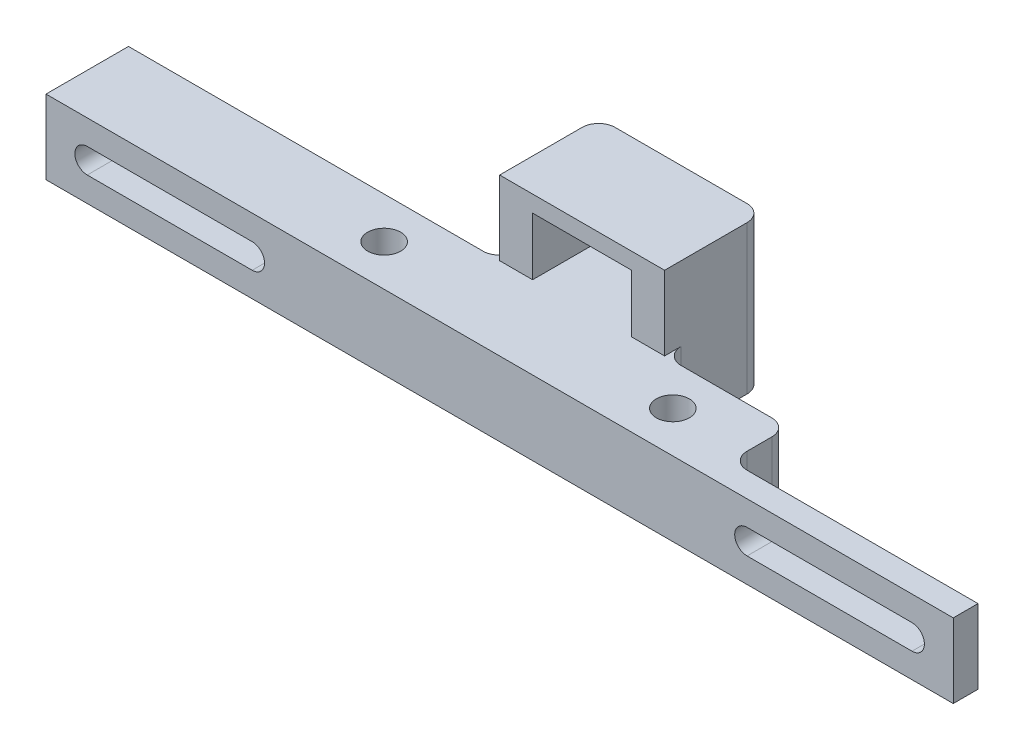
ISO-10303-21;
HEADER;
FILE_DESCRIPTION(('STEP AP214'),'2;1');
FILE_NAME('part.step','',(''),(''),'','','');
FILE_SCHEMA(('AUTOMOTIVE_DESIGN { 1 0 10303 214 1 1 1 1 }'));
ENDSEC;
DATA;
#1=APPLICATION_CONTEXT('core data for automotive mechanical design processes');
#2=APPLICATION_PROTOCOL_DEFINITION('international standard','automotive_design',2000,#1);
#3=PRODUCT_CONTEXT('',#1,'mechanical');
#4=PRODUCT('Part','Part','',(#3));
#5=PRODUCT_RELATED_PRODUCT_CATEGORY('part','',(#4));
#6=PRODUCT_DEFINITION_FORMATION('','',#4);
#7=PRODUCT_DEFINITION_CONTEXT('part definition',#1,'design');
#8=PRODUCT_DEFINITION('design','',#6,#7);
#9=PRODUCT_DEFINITION_SHAPE('','',#8);
#10=(LENGTH_UNIT() NAMED_UNIT(*) SI_UNIT(.MILLI.,.METRE.));
#11=(NAMED_UNIT(*) PLANE_ANGLE_UNIT() SI_UNIT($,.RADIAN.));
#12=(NAMED_UNIT(*) SI_UNIT($,.STERADIAN.) SOLID_ANGLE_UNIT());
#13=UNCERTAINTY_MEASURE_WITH_UNIT(LENGTH_MEASURE(1.E-05),#10,'distance_accuracy_value','');
#14=(GEOMETRIC_REPRESENTATION_CONTEXT(3) GLOBAL_UNCERTAINTY_ASSIGNED_CONTEXT((#13)) GLOBAL_UNIT_ASSIGNED_CONTEXT((#10,
#11,#12)) REPRESENTATION_CONTEXT('',''));
#15=CARTESIAN_POINT('',(0.,0.,0.));
#16=DIRECTION('',(0.,0.,1.));
#17=DIRECTION('',(1.,0.,0.));
#18=AXIS2_PLACEMENT_3D('',#15,#16,#17);
#19=CARTESIAN_POINT('',(0.,0.,0.));
#20=DIRECTION('',(0.,0.,1.));
#21=DIRECTION('',(1.,0.,0.));
#22=AXIS2_PLACEMENT_3D('',#19,#20,#21);
#23=PLANE('',#22);
#24=DIRECTION('',(-1.,0.,0.));
#25=VECTOR('',#24,1.);
#26=CARTESIAN_POINT('',(0.,4.5,0.));
#27=LINE('',#26,#25);
#28=CARTESIAN_POINT('',(23.,4.5,0.));
#29=VERTEX_POINT('',#28);
#30=CARTESIAN_POINT('',(12.,4.5,0.));
#31=VERTEX_POINT('',#30);
#32=EDGE_CURVE('E285',#29,#31,#27,.T.);
#33=ORIENTED_EDGE('',*,*,#32,.F.);
#34=DIRECTION('',(0.,1.,0.));
#35=VECTOR('',#34,1.);
#36=CARTESIAN_POINT('',(23.,0.,0.));
#37=LINE('',#36,#35);
#38=CARTESIAN_POINT('',(23.,-4.5,0.));
#39=VERTEX_POINT('',#38);
#40=EDGE_CURVE('E319',#29,#39,#37,.F.);
#41=ORIENTED_EDGE('',*,*,#40,.T.);
#42=DIRECTION('',(-1.,0.,0.));
#43=VECTOR('',#42,1.);
#44=CARTESIAN_POINT('',(0.,-4.5,0.));
#45=LINE('',#44,#43);
#46=CARTESIAN_POINT('',(12.,-4.5,0.));
#47=VERTEX_POINT('',#46);
#48=EDGE_CURVE('E307',#39,#47,#45,.T.);
#49=ORIENTED_EDGE('',*,*,#48,.T.);
#50=DIRECTION('',(0.,-1.,0.));
#51=VECTOR('',#50,1.);
#52=CARTESIAN_POINT('',(12.,4.5,0.));
#53=LINE('',#52,#51);
#54=EDGE_CURVE('E306',#47,#31,#53,.F.);
#55=ORIENTED_EDGE('',*,*,#54,.T.);
#56=EDGE_LOOP('',(#33,#41,#49,#55));
#57=FACE_BOUND('',#56,.T.);
#58=ADVANCED_FACE('F33',(#57),#23,.F.);
#59=CARTESIAN_POINT('',(-30.,0.,10.));
#60=DIRECTION('',(0.,0.,-1.));
#61=DIRECTION('',(-1.,0.,0.));
#62=AXIS2_PLACEMENT_3D('',#59,#60,#61);
#63=CYLINDRICAL_SURFACE('',#62,1.5);
#64=CARTESIAN_POINT('',(-30.,0.,0.));
#65=DIRECTION('',(0.,0.,1.));
#66=DIRECTION('',(1.,0.,0.));
#67=AXIS2_PLACEMENT_3D('',#64,#65,#66);
#68=CIRCLE('',#67,1.5);
#69=CARTESIAN_POINT('',(-30.,-1.5,0.));
#70=VERTEX_POINT('',#69);
#71=CARTESIAN_POINT('',(-30.,1.5,0.));
#72=VERTEX_POINT('',#71);
#73=EDGE_CURVE('E310',#70,#72,#68,.T.);
#74=ORIENTED_EDGE('',*,*,#73,.F.);
#75=DIRECTION('',(0.,0.,-1.));
#76=VECTOR('',#75,1.);
#77=CARTESIAN_POINT('',(-30.,-1.5,10.));
#78=LINE('',#77,#76);
#79=CARTESIAN_POINT('',(-30.,-1.5,10.));
#80=VERTEX_POINT('',#79);
#81=EDGE_CURVE('E356',#80,#70,#78,.T.);
#82=ORIENTED_EDGE('',*,*,#81,.F.);
#83=CARTESIAN_POINT('',(-30.,0.,10.));
#84=DIRECTION('',(0.,0.,1.));
#85=DIRECTION('',(1.,0.,0.));
#86=AXIS2_PLACEMENT_3D('',#83,#84,#85);
#87=CIRCLE('',#86,1.5);
#88=CARTESIAN_POINT('',(-30.,1.5,10.));
#89=VERTEX_POINT('',#88);
#90=EDGE_CURVE('E424',#80,#89,#87,.T.);
#91=ORIENTED_EDGE('',*,*,#90,.T.);
#92=DIRECTION('',(0.,0.,-1.));
#93=VECTOR('',#92,1.);
#94=CARTESIAN_POINT('',(-30.,1.5,10.));
#95=LINE('',#94,#93);
#96=EDGE_CURVE('E269',#89,#72,#95,.T.);
#97=ORIENTED_EDGE('',*,*,#96,.T.);
#98=EDGE_LOOP('',(#74,#82,#91,#97));
#99=FACE_BOUND('',#98,.T.);
#100=ADVANCED_FACE('F449',(#99),#63,.F.);
#101=CARTESIAN_POINT('',(0.,-1.5,10.));
#102=DIRECTION('',(0.,1.,0.));
#103=DIRECTION('',(-1.,0.,0.));
#104=AXIS2_PLACEMENT_3D('',#101,#102,#103);
#105=PLANE('',#104);
#106=DIRECTION('',(1.,0.,0.));
#107=VECTOR('',#106,1.);
#108=CARTESIAN_POINT('',(0.,-1.5,0.));
#109=LINE('',#108,#107);
#110=CARTESIAN_POINT('',(-50.,-1.5,0.));
#111=VERTEX_POINT('',#110);
#112=EDGE_CURVE('E461',#111,#70,#109,.T.);
#113=ORIENTED_EDGE('',*,*,#112,.F.);
#114=DIRECTION('',(0.,0.,-1.));
#115=VECTOR('',#114,1.);
#116=CARTESIAN_POINT('',(-50.,-1.5,10.));
#117=LINE('',#116,#115);
#118=CARTESIAN_POINT('',(-50.,-1.5,10.));
#119=VERTEX_POINT('',#118);
#120=EDGE_CURVE('E453',#119,#111,#117,.T.);
#121=ORIENTED_EDGE('',*,*,#120,.F.);
#122=DIRECTION('',(1.,0.,0.));
#123=VECTOR('',#122,1.);
#124=CARTESIAN_POINT('',(0.,-1.5,10.));
#125=LINE('',#124,#123);
#126=EDGE_CURVE('E427',#119,#80,#125,.T.);
#127=ORIENTED_EDGE('',*,*,#126,.T.);
#128=ORIENTED_EDGE('',*,*,#81,.T.);
#129=EDGE_LOOP('',(#113,#121,#127,#128));
#130=FACE_BOUND('',#129,.T.);
#131=ADVANCED_FACE('F464',(#130),#105,.T.);
#132=CARTESIAN_POINT('',(-50.,0.,10.));
#133=DIRECTION('',(0.,0.,-1.));
#134=DIRECTION('',(-1.,0.,0.));
#135=AXIS2_PLACEMENT_3D('',#132,#133,#134);
#136=CYLINDRICAL_SURFACE('',#135,1.5);
#137=CARTESIAN_POINT('',(-50.,0.,0.));
#138=DIRECTION('',(0.,0.,1.));
#139=DIRECTION('',(1.,0.,0.));
#140=AXIS2_PLACEMENT_3D('',#137,#138,#139);
#141=CIRCLE('',#140,1.5);
#142=CARTESIAN_POINT('',(-50.,1.5,0.));
#143=VERTEX_POINT('',#142);
#144=EDGE_CURVE('E459',#143,#111,#141,.T.);
#145=ORIENTED_EDGE('',*,*,#144,.F.);
#146=DIRECTION('',(0.,0.,-1.));
#147=VECTOR('',#146,1.);
#148=CARTESIAN_POINT('',(-50.,1.5,10.));
#149=LINE('',#148,#147);
#150=CARTESIAN_POINT('',(-50.,1.5,10.));
#151=VERTEX_POINT('',#150);
#152=EDGE_CURVE('E447',#151,#143,#149,.T.);
#153=ORIENTED_EDGE('',*,*,#152,.F.);
#154=CARTESIAN_POINT('',(-50.,0.,10.));
#155=DIRECTION('',(0.,0.,1.));
#156=DIRECTION('',(1.,0.,0.));
#157=AXIS2_PLACEMENT_3D('',#154,#155,#156);
#158=CIRCLE('',#157,1.5);
#159=EDGE_CURVE('E429',#151,#119,#158,.T.);
#160=ORIENTED_EDGE('',*,*,#159,.T.);
#161=ORIENTED_EDGE('',*,*,#120,.T.);
#162=EDGE_LOOP('',(#145,#153,#160,#161));
#163=FACE_BOUND('',#162,.T.);
#164=ADVANCED_FACE('F463',(#163),#136,.F.);
#165=CARTESIAN_POINT('',(0.,4.5,10.));
#166=DIRECTION('',(0.,-1.,0.));
#167=DIRECTION('',(1.,0.,0.));
#168=AXIS2_PLACEMENT_3D('',#165,#166,#167);
#169=PLANE('',#168);
#170=CARTESIAN_POINT('',(16.,4.5,5.));
#171=DIRECTION('',(0.,1.,0.));
#172=DIRECTION('',(-1.,0.,0.));
#173=AXIS2_PLACEMENT_3D('',#170,#171,#172);
#174=CIRCLE('',#173,2.);
#175=CARTESIAN_POINT('',(14.,4.5,5.));
#176=VERTEX_POINT('',#175);
#177=EDGE_CURVE('E542',#176,#176,#174,.T.);
#178=ORIENTED_EDGE('',*,*,#177,.F.);
#179=EDGE_LOOP('',(#178));
#180=FACE_BOUND('',#179,.T.);
#181=CARTESIAN_POINT('',(-19.,4.5,5.));
#182=DIRECTION('',(0.,1.,0.));
#183=DIRECTION('',(-1.,0.,0.));
#184=AXIS2_PLACEMENT_3D('',#181,#182,#183);
#185=CIRCLE('',#184,2.);
#186=CARTESIAN_POINT('',(-21.,4.5,5.));
#187=VERTEX_POINT('',#186);
#188=EDGE_CURVE('E547',#187,#187,#185,.T.);
#189=ORIENTED_EDGE('',*,*,#188,.F.);
#190=EDGE_LOOP('',(#189));
#191=FACE_BOUND('',#190,.T.);
#192=DIRECTION('',(0.,0.,1.));
#193=VECTOR('',#192,1.);
#194=CARTESIAN_POINT('',(25.,4.5,0.));
#195=LINE('',#194,#193);
#196=CARTESIAN_POINT('',(25.,4.5,2.));
#197=VERTEX_POINT('',#196);
#198=CARTESIAN_POINT('',(25.,4.5,5.));
#199=VERTEX_POINT('',#198);
#200=EDGE_CURVE('E366',#197,#199,#195,.T.);
#201=ORIENTED_EDGE('',*,*,#200,.F.);
#202=CARTESIAN_POINT('',(23.,4.5,2.));
#203=DIRECTION('',(0.,-1.,0.));
#204=DIRECTION('',(1.,0.,0.));
#205=AXIS2_PLACEMENT_3D('',#202,#203,#204);
#206=CIRCLE('',#205,2.);
#207=EDGE_CURVE('E304',#197,#29,#206,.F.);
#208=ORIENTED_EDGE('',*,*,#207,.T.);
#209=ORIENTED_EDGE('',*,*,#32,.T.);
#210=CARTESIAN_POINT('',(12.,4.5,-2.));
#211=DIRECTION('',(0.,-1.,0.));
#212=DIRECTION('',(1.,0.,0.));
#213=AXIS2_PLACEMENT_3D('',#210,#211,#212);
#214=CIRCLE('',#213,2.);
#215=CARTESIAN_POINT('',(10.,4.5,-2.));
#216=VERTEX_POINT('',#215);
#217=EDGE_CURVE('E375',#31,#216,#214,.T.);
#218=ORIENTED_EDGE('',*,*,#217,.T.);
#219=DIRECTION('',(0.,0.,-1.));
#220=VECTOR('',#219,1.);
#221=CARTESIAN_POINT('',(10.,4.5,10.));
#222=LINE('',#221,#220);
#223=CARTESIAN_POINT('',(10.,4.5,0.));
#224=VERTEX_POINT('',#223);
#225=EDGE_CURVE('E48',#224,#216,#222,.T.);
#226=ORIENTED_EDGE('',*,*,#225,.F.);
#227=CARTESIAN_POINT('',(6.,4.5,0.));
#228=VERTEX_POINT('',#227);
#229=EDGE_CURVE('E282',#224,#228,#27,.T.);
#230=ORIENTED_EDGE('',*,*,#229,.T.);
#231=DIRECTION('',(0.,0.,1.));
#232=VECTOR('',#231,1.);
#233=CARTESIAN_POINT('',(6.,4.5,-12.));
#234=LINE('',#233,#232);
#235=CARTESIAN_POINT('',(6.,4.5,-12.));
#236=VERTEX_POINT('',#235);
#237=EDGE_CURVE('E332',#236,#228,#234,.T.);
#238=ORIENTED_EDGE('',*,*,#237,.F.);
#239=DIRECTION('',(-1.,0.,0.));
#240=VECTOR('',#239,1.);
#241=CARTESIAN_POINT('',(0.,4.5,-12.));
#242=LINE('',#241,#240);
#243=CARTESIAN_POINT('',(-6.,4.5,-12.));
#244=VERTEX_POINT('',#243);
#245=EDGE_CURVE('E564',#236,#244,#242,.T.);
#246=ORIENTED_EDGE('',*,*,#245,.T.);
#247=DIRECTION('',(0.,0.,1.));
#248=VECTOR('',#247,1.);
#249=CARTESIAN_POINT('',(-6.,4.5,-12.));
#250=LINE('',#249,#248);
#251=CARTESIAN_POINT('',(-6.,4.5,0.));
#252=VERTEX_POINT('',#251);
#253=EDGE_CURVE('E328',#244,#252,#250,.T.);
#254=ORIENTED_EDGE('',*,*,#253,.T.);
#255=CARTESIAN_POINT('',(-10.,4.5,0.));
#256=VERTEX_POINT('',#255);
#257=EDGE_CURVE('E286',#252,#256,#27,.T.);
#258=ORIENTED_EDGE('',*,*,#257,.T.);
#259=DIRECTION('',(0.,0.,1.));
#260=VECTOR('',#259,1.);
#261=CARTESIAN_POINT('',(-10.,4.5,-12.));
#262=LINE('',#261,#260);
#263=CARTESIAN_POINT('',(-10.,4.5,-2.));
#264=VERTEX_POINT('',#263);
#265=EDGE_CURVE('E54',#264,#256,#262,.T.);
#266=ORIENTED_EDGE('',*,*,#265,.F.);
#267=CARTESIAN_POINT('',(-12.,4.5,-2.));
#268=DIRECTION('',(0.,-1.,0.));
#269=DIRECTION('',(1.,0.,0.));
#270=AXIS2_PLACEMENT_3D('',#267,#268,#269);
#271=CIRCLE('',#270,2.);
#272=CARTESIAN_POINT('',(-12.,4.5,0.));
#273=VERTEX_POINT('',#272);
#274=EDGE_CURVE('E11',#264,#273,#271,.T.);
#275=ORIENTED_EDGE('',*,*,#274,.T.);
#276=CARTESIAN_POINT('',(-55.,4.49999999999999,0.));
#277=VERTEX_POINT('',#276);
#278=EDGE_CURVE('E298',#273,#277,#27,.T.);
#279=ORIENTED_EDGE('',*,*,#278,.T.);
#280=DIRECTION('',(0.,0.,-1.));
#281=VECTOR('',#280,1.);
#282=CARTESIAN_POINT('',(-55.,4.49999999999999,10.));
#283=LINE('',#282,#281);
#284=CARTESIAN_POINT('',(-55.,4.49999999999999,10.));
#285=VERTEX_POINT('',#284);
#286=EDGE_CURVE('E261',#285,#277,#283,.T.);
#287=ORIENTED_EDGE('',*,*,#286,.F.);
#288=DIRECTION('',(-1.,0.,0.));
#289=VECTOR('',#288,1.);
#290=CARTESIAN_POINT('',(0.,4.5,10.));
#291=LINE('',#290,#289);
#292=CARTESIAN_POINT('',(55.,4.50000000000001,10.));
#293=VERTEX_POINT('',#292);
#294=EDGE_CURVE('E416',#293,#285,#291,.T.);
#295=ORIENTED_EDGE('',*,*,#294,.F.);
#296=DIRECTION('',(0.,0.,-1.));
#297=VECTOR('',#296,1.);
#298=CARTESIAN_POINT('',(55.,4.50000000000001,10.));
#299=LINE('',#298,#297);
#300=CARTESIAN_POINT('',(55.,4.50000000000001,7.));
#301=VERTEX_POINT('',#300);
#302=EDGE_CURVE('E258',#293,#301,#299,.T.);
#303=ORIENTED_EDGE('',*,*,#302,.T.);
#304=DIRECTION('',(1.,0.,0.));
#305=VECTOR('',#304,1.);
#306=CARTESIAN_POINT('',(55.,4.50000000000001,7.));
#307=LINE('',#306,#305);
#308=CARTESIAN_POINT('',(27.,4.5,7.));
#309=VERTEX_POINT('',#308);
#310=EDGE_CURVE('E248',#309,#301,#307,.T.);
#311=ORIENTED_EDGE('',*,*,#310,.F.);
#312=CARTESIAN_POINT('',(27.,4.5,5.));
#313=DIRECTION('',(0.,-1.,0.));
#314=DIRECTION('',(1.,0.,0.));
#315=AXIS2_PLACEMENT_3D('',#312,#313,#314);
#316=CIRCLE('',#315,2.);
#317=EDGE_CURVE('E373',#309,#199,#316,.T.);
#318=ORIENTED_EDGE('',*,*,#317,.T.);
#319=EDGE_LOOP('',(#201,#208,#209,#218,#226,#230,#238,#246,#254,#258,#266,#275,#279,#287,#295,
#303,#311,#318));
#320=FACE_BOUND('',#319,.T.);
#321=ADVANCED_FACE('F407',(#180,#191,#320),#169,.F.);
#322=CARTESIAN_POINT('',(-55.,0.,10.));
#323=DIRECTION('',(-1.,0.,0.));
#324=DIRECTION('',(0.,0.,1.));
#325=AXIS2_PLACEMENT_3D('',#322,#323,#324);
#326=PLANE('',#325);
#327=DIRECTION('',(0.,1.,0.));
#328=VECTOR('',#327,1.);
#329=CARTESIAN_POINT('',(-55.,0.,0.));
#330=LINE('',#329,#328);
#331=CARTESIAN_POINT('',(-55.,-4.50000000000001,0.));
#332=VERTEX_POINT('',#331);
#333=EDGE_CURVE('E292',#332,#277,#330,.T.);
#334=ORIENTED_EDGE('',*,*,#333,.F.);
#335=DIRECTION('',(0.,0.,-1.));
#336=VECTOR('',#335,1.);
#337=CARTESIAN_POINT('',(-55.,-4.50000000000001,10.));
#338=LINE('',#337,#336);
#339=CARTESIAN_POINT('',(-55.,-4.50000000000001,10.));
#340=VERTEX_POINT('',#339);
#341=EDGE_CURVE('E257',#340,#332,#338,.T.);
#342=ORIENTED_EDGE('',*,*,#341,.F.);
#343=DIRECTION('',(0.,1.,0.));
#344=VECTOR('',#343,1.);
#345=CARTESIAN_POINT('',(-55.,0.,10.));
#346=LINE('',#345,#344);
#347=EDGE_CURVE('E413',#340,#285,#346,.T.);
#348=ORIENTED_EDGE('',*,*,#347,.T.);
#349=ORIENTED_EDGE('',*,*,#286,.T.);
#350=EDGE_LOOP('',(#334,#342,#348,#349));
#351=FACE_BOUND('',#350,.T.);
#352=ADVANCED_FACE('F411',(#351),#326,.T.);
#353=CARTESIAN_POINT('',(0.,-4.5,10.));
#354=DIRECTION('',(0.,-1.,0.));
#355=DIRECTION('',(1.,0.,0.));
#356=AXIS2_PLACEMENT_3D('',#353,#354,#355);
#357=PLANE('',#356);
#358=CARTESIAN_POINT('',(16.,-4.5,5.));
#359=DIRECTION('',(0.,-1.,0.));
#360=DIRECTION('',(1.,0.,0.));
#361=AXIS2_PLACEMENT_3D('',#358,#359,#360);
#362=CIRCLE('',#361,2.);
#363=CARTESIAN_POINT('',(18.,-4.5,5.));
#364=VERTEX_POINT('',#363);
#365=EDGE_CURVE('E545',#364,#364,#362,.F.);
#366=ORIENTED_EDGE('',*,*,#365,.T.);
#367=EDGE_LOOP('',(#366));
#368=FACE_BOUND('',#367,.T.);
#369=CARTESIAN_POINT('',(-19.,-4.50000000000001,5.));
#370=DIRECTION('',(0.,-1.,0.));
#371=DIRECTION('',(1.,0.,0.));
#372=AXIS2_PLACEMENT_3D('',#369,#370,#371);
#373=CIRCLE('',#372,2.);
#374=CARTESIAN_POINT('',(-17.,-4.50000000000001,5.));
#375=VERTEX_POINT('',#374);
#376=EDGE_CURVE('E550',#375,#375,#373,.F.);
#377=ORIENTED_EDGE('',*,*,#376,.T.);
#378=EDGE_LOOP('',(#377));
#379=FACE_BOUND('',#378,.T.);
#380=ORIENTED_EDGE('',*,*,#48,.F.);
#381=CARTESIAN_POINT('',(23.,-4.5,2.));
#382=DIRECTION('',(0.,-1.,0.));
#383=DIRECTION('',(1.,0.,0.));
#384=AXIS2_PLACEMENT_3D('',#381,#382,#383);
#385=CIRCLE('',#384,2.);
#386=CARTESIAN_POINT('',(25.,-4.5,2.));
#387=VERTEX_POINT('',#386);
#388=EDGE_CURVE('E369',#39,#387,#385,.T.);
#389=ORIENTED_EDGE('',*,*,#388,.T.);
#390=DIRECTION('',(0.,0.,1.));
#391=VECTOR('',#390,1.);
#392=CARTESIAN_POINT('',(25.,-4.5,0.));
#393=LINE('',#392,#391);
#394=CARTESIAN_POINT('',(25.,-4.5,5.));
#395=VERTEX_POINT('',#394);
#396=EDGE_CURVE('E243',#387,#395,#393,.T.);
#397=ORIENTED_EDGE('',*,*,#396,.T.);
#398=CARTESIAN_POINT('',(27.,-4.5,5.));
#399=DIRECTION('',(0.,-1.,0.));
#400=DIRECTION('',(1.,0.,0.));
#401=AXIS2_PLACEMENT_3D('',#398,#399,#400);
#402=CIRCLE('',#401,2.);
#403=CARTESIAN_POINT('',(27.,-4.5,7.));
#404=VERTEX_POINT('',#403);
#405=EDGE_CURVE('E238',#395,#404,#402,.F.);
#406=ORIENTED_EDGE('',*,*,#405,.T.);
#407=DIRECTION('',(1.,0.,0.));
#408=VECTOR('',#407,1.);
#409=CARTESIAN_POINT('',(55.,-4.5,7.));
#410=LINE('',#409,#408);
#411=CARTESIAN_POINT('',(55.,-4.5,7.));
#412=VERTEX_POINT('',#411);
#413=EDGE_CURVE('E228',#404,#412,#410,.T.);
#414=ORIENTED_EDGE('',*,*,#413,.T.);
#415=DIRECTION('',(0.,0.,-1.));
#416=VECTOR('',#415,1.);
#417=CARTESIAN_POINT('',(55.,-4.5,10.));
#418=LINE('',#417,#416);
#419=CARTESIAN_POINT('',(55.,-4.5,10.));
#420=VERTEX_POINT('',#419);
#421=EDGE_CURVE('E234',#420,#412,#418,.T.);
#422=ORIENTED_EDGE('',*,*,#421,.F.);
#423=DIRECTION('',(-1.,0.,0.));
#424=VECTOR('',#423,1.);
#425=CARTESIAN_POINT('',(0.,-4.5,10.));
#426=LINE('',#425,#424);
#427=EDGE_CURVE('E415',#420,#340,#426,.T.);
#428=ORIENTED_EDGE('',*,*,#427,.T.);
#429=ORIENTED_EDGE('',*,*,#341,.T.);
#430=CARTESIAN_POINT('',(-12.,-4.5,0.));
#431=VERTEX_POINT('',#430);
#432=EDGE_CURVE('E311',#431,#332,#45,.T.);
#433=ORIENTED_EDGE('',*,*,#432,.F.);
#434=CARTESIAN_POINT('',(-12.,-4.5,-2.));
#435=DIRECTION('',(0.,-1.,0.));
#436=DIRECTION('',(1.,0.,0.));
#437=AXIS2_PLACEMENT_3D('',#434,#435,#436);
#438=CIRCLE('',#437,2.);
#439=CARTESIAN_POINT('',(-10.,-4.5,-2.));
#440=VERTEX_POINT('',#439);
#441=EDGE_CURVE('E41',#431,#440,#438,.F.);
#442=ORIENTED_EDGE('',*,*,#441,.T.);
#443=DIRECTION('',(0.,0.,1.));
#444=VECTOR('',#443,1.);
#445=CARTESIAN_POINT('',(-10.,-4.5,-12.));
#446=LINE('',#445,#444);
#447=CARTESIAN_POINT('',(-10.,-4.5,-10.));
#448=VERTEX_POINT('',#447);
#449=EDGE_CURVE('E320',#448,#440,#446,.T.);
#450=ORIENTED_EDGE('',*,*,#449,.F.);
#451=CARTESIAN_POINT('',(-8.,-4.5,-10.));
#452=DIRECTION('',(0.,-1.,0.));
#453=DIRECTION('',(1.,0.,0.));
#454=AXIS2_PLACEMENT_3D('',#451,#452,#453);
#455=CIRCLE('',#454,2.);
#456=CARTESIAN_POINT('',(-8.,-4.5,-12.));
#457=VERTEX_POINT('',#456);
#458=EDGE_CURVE('E662',#448,#457,#455,.T.);
#459=ORIENTED_EDGE('',*,*,#458,.T.);
#460=DIRECTION('',(-1.,0.,0.));
#461=VECTOR('',#460,1.);
#462=CARTESIAN_POINT('',(0.,-4.5,-12.));
#463=LINE('',#462,#461);
#464=CARTESIAN_POINT('',(8.,-4.5,-12.));
#465=VERTEX_POINT('',#464);
#466=EDGE_CURVE('E343',#465,#457,#463,.T.);
#467=ORIENTED_EDGE('',*,*,#466,.F.);
#468=CARTESIAN_POINT('',(8.,-4.5,-10.));
#469=DIRECTION('',(0.,-1.,0.));
#470=DIRECTION('',(1.,0.,0.));
#471=AXIS2_PLACEMENT_3D('',#468,#469,#470);
#472=CIRCLE('',#471,2.);
#473=CARTESIAN_POINT('',(10.,-4.5,-10.));
#474=VERTEX_POINT('',#473);
#475=EDGE_CURVE('E661',#465,#474,#472,.T.);
#476=ORIENTED_EDGE('',*,*,#475,.T.);
#477=DIRECTION('',(0.,0.,1.));
#478=VECTOR('',#477,1.);
#479=CARTESIAN_POINT('',(10.,-4.5,-12.));
#480=LINE('',#479,#478);
#481=CARTESIAN_POINT('',(10.,-4.5,-2.));
#482=VERTEX_POINT('',#481);
#483=EDGE_CURVE('E301',#474,#482,#480,.T.);
#484=ORIENTED_EDGE('',*,*,#483,.T.);
#485=CARTESIAN_POINT('',(12.,-4.5,-2.));
#486=DIRECTION('',(0.,-1.,0.));
#487=DIRECTION('',(1.,0.,0.));
#488=AXIS2_PLACEMENT_3D('',#485,#486,#487);
#489=CIRCLE('',#488,2.);
#490=EDGE_CURVE('E372',#482,#47,#489,.F.);
#491=ORIENTED_EDGE('',*,*,#490,.T.);
#492=EDGE_LOOP('',(#380,#389,#397,#406,#414,#422,#428,#429,#433,#442,#450,#459,#467,#476,#484,#491));
#493=FACE_BOUND('',#492,.T.);
#494=ADVANCED_FACE('F231',(#368,#379,#493),#357,.T.);
#495=CARTESIAN_POINT('',(50.,0.,10.));
#496=DIRECTION('',(0.,0.,-1.));
#497=DIRECTION('',(-1.,0.,0.));
#498=AXIS2_PLACEMENT_3D('',#495,#496,#497);
#499=CYLINDRICAL_SURFACE('',#498,1.5);
#500=CARTESIAN_POINT('',(50.,0.,7.));
#501=DIRECTION('',(0.,0.,1.));
#502=DIRECTION('',(1.,0.,0.));
#503=AXIS2_PLACEMENT_3D('',#500,#501,#502);
#504=CIRCLE('',#503,1.5);
#505=CARTESIAN_POINT('',(50.,-1.5,7.));
#506=VERTEX_POINT('',#505);
#507=CARTESIAN_POINT('',(50.,1.5,7.));
#508=VERTEX_POINT('',#507);
#509=EDGE_CURVE('E348',#506,#508,#504,.T.);
#510=ORIENTED_EDGE('',*,*,#509,.F.);
#511=DIRECTION('',(0.,0.,-1.));
#512=VECTOR('',#511,1.);
#513=CARTESIAN_POINT('',(50.,-1.5,10.));
#514=LINE('',#513,#512);
#515=CARTESIAN_POINT('',(50.,-1.5,10.));
#516=VERTEX_POINT('',#515);
#517=EDGE_CURVE('E263',#516,#506,#514,.T.);
#518=ORIENTED_EDGE('',*,*,#517,.F.);
#519=CARTESIAN_POINT('',(50.,0.,10.));
#520=DIRECTION('',(0.,0.,1.));
#521=DIRECTION('',(1.,0.,0.));
#522=AXIS2_PLACEMENT_3D('',#519,#520,#521);
#523=CIRCLE('',#522,1.5);
#524=CARTESIAN_POINT('',(50.,1.5,10.));
#525=VERTEX_POINT('',#524);
#526=EDGE_CURVE('E458',#516,#525,#523,.T.);
#527=ORIENTED_EDGE('',*,*,#526,.T.);
#528=DIRECTION('',(0.,0.,-1.));
#529=VECTOR('',#528,1.);
#530=CARTESIAN_POINT('',(50.,1.5,10.));
#531=LINE('',#530,#529);
#532=EDGE_CURVE('E270',#525,#508,#531,.T.);
#533=ORIENTED_EDGE('',*,*,#532,.T.);
#534=EDGE_LOOP('',(#510,#518,#527,#533));
#535=FACE_BOUND('',#534,.T.);
#536=ADVANCED_FACE('F608',(#535),#499,.F.);
#537=CARTESIAN_POINT('',(0.,-1.5,10.));
#538=DIRECTION('',(0.,1.,0.));
#539=DIRECTION('',(0.,0.,1.));
#540=AXIS2_PLACEMENT_3D('',#537,#538,#539);
#541=PLANE('',#540);
#542=DIRECTION('',(1.,0.,0.));
#543=VECTOR('',#542,1.);
#544=CARTESIAN_POINT('',(0.,-1.5,7.00000000000001));
#545=LINE('',#544,#543);
#546=CARTESIAN_POINT('',(30.,-1.5,7.));
#547=VERTEX_POINT('',#546);
#548=EDGE_CURVE('E559',#547,#506,#545,.T.);
#549=ORIENTED_EDGE('',*,*,#548,.F.);
#550=DIRECTION('',(0.,0.,-1.));
#551=VECTOR('',#550,1.);
#552=CARTESIAN_POINT('',(30.,-1.5,10.));
#553=LINE('',#552,#551);
#554=CARTESIAN_POINT('',(30.,-1.5,10.));
#555=VERTEX_POINT('',#554);
#556=EDGE_CURVE('E277',#555,#547,#553,.T.);
#557=ORIENTED_EDGE('',*,*,#556,.F.);
#558=DIRECTION('',(1.,0.,0.));
#559=VECTOR('',#558,1.);
#560=CARTESIAN_POINT('',(0.,-1.5,10.));
#561=LINE('',#560,#559);
#562=EDGE_CURVE('E596',#555,#516,#561,.T.);
#563=ORIENTED_EDGE('',*,*,#562,.T.);
#564=ORIENTED_EDGE('',*,*,#517,.T.);
#565=EDGE_LOOP('',(#549,#557,#563,#564));
#566=FACE_BOUND('',#565,.T.);
#567=ADVANCED_FACE('F611',(#566),#541,.T.);
#568=CARTESIAN_POINT('',(30.,0.,10.));
#569=DIRECTION('',(0.,0.,-1.));
#570=DIRECTION('',(-1.,0.,0.));
#571=AXIS2_PLACEMENT_3D('',#568,#569,#570);
#572=CYLINDRICAL_SURFACE('',#571,1.5);
#573=CARTESIAN_POINT('',(30.,0.,7.));
#574=DIRECTION('',(0.,0.,1.));
#575=DIRECTION('',(1.,0.,0.));
#576=AXIS2_PLACEMENT_3D('',#573,#574,#575);
#577=CIRCLE('',#576,1.5);
#578=CARTESIAN_POINT('',(30.,1.5,7.));
#579=VERTEX_POINT('',#578);
#580=EDGE_CURVE('E252',#579,#547,#577,.T.);
#581=ORIENTED_EDGE('',*,*,#580,.F.);
#582=DIRECTION('',(0.,0.,-1.));
#583=VECTOR('',#582,1.);
#584=CARTESIAN_POINT('',(30.,1.5,10.));
#585=LINE('',#584,#583);
#586=CARTESIAN_POINT('',(30.,1.5,10.));
#587=VERTEX_POINT('',#586);
#588=EDGE_CURVE('E273',#587,#579,#585,.T.);
#589=ORIENTED_EDGE('',*,*,#588,.F.);
#590=CARTESIAN_POINT('',(30.,0.,10.));
#591=DIRECTION('',(0.,0.,1.));
#592=DIRECTION('',(1.,0.,0.));
#593=AXIS2_PLACEMENT_3D('',#590,#591,#592);
#594=CIRCLE('',#593,1.5);
#595=EDGE_CURVE('E599',#587,#555,#594,.T.);
#596=ORIENTED_EDGE('',*,*,#595,.T.);
#597=ORIENTED_EDGE('',*,*,#556,.T.);
#598=EDGE_LOOP('',(#581,#589,#596,#597));
#599=FACE_BOUND('',#598,.T.);
#600=ADVANCED_FACE('F614',(#599),#572,.F.);
#601=CARTESIAN_POINT('',(55.,0.,10.));
#602=DIRECTION('',(-1.,0.,0.));
#603=DIRECTION('',(0.,0.,1.));
#604=AXIS2_PLACEMENT_3D('',#601,#602,#603);
#605=PLANE('',#604);
#606=ORIENTED_EDGE('',*,*,#421,.T.);
#607=DIRECTION('',(0.,1.,0.));
#608=VECTOR('',#607,1.);
#609=CARTESIAN_POINT('',(55.,-35.3058436014987,7.));
#610=LINE('',#609,#608);
#611=EDGE_CURVE('E242',#412,#301,#610,.T.);
#612=ORIENTED_EDGE('',*,*,#611,.T.);
#613=ORIENTED_EDGE('',*,*,#302,.F.);
#614=DIRECTION('',(0.,1.,0.));
#615=VECTOR('',#614,1.);
#616=CARTESIAN_POINT('',(55.,0.,10.));
#617=LINE('',#616,#615);
#618=EDGE_CURVE('E255',#420,#293,#617,.T.);
#619=ORIENTED_EDGE('',*,*,#618,.F.);
#620=EDGE_LOOP('',(#606,#612,#613,#619));
#621=FACE_BOUND('',#620,.T.);
#622=ADVANCED_FACE('F254',(#621),#605,.F.);
#623=CARTESIAN_POINT('',(0.,1.5,10.));
#624=DIRECTION('',(0.,1.,0.));
#625=DIRECTION('',(0.,0.,1.));
#626=AXIS2_PLACEMENT_3D('',#623,#624,#625);
#627=PLANE('',#626);
#628=ORIENTED_EDGE('',*,*,#588,.T.);
#629=DIRECTION('',(1.,0.,0.));
#630=VECTOR('',#629,1.);
#631=CARTESIAN_POINT('',(0.,1.5,7.00000000000001));
#632=LINE('',#631,#630);
#633=EDGE_CURVE('E352',#579,#508,#632,.T.);
#634=ORIENTED_EDGE('',*,*,#633,.T.);
#635=ORIENTED_EDGE('',*,*,#532,.F.);
#636=DIRECTION('',(1.,0.,0.));
#637=VECTOR('',#636,1.);
#638=CARTESIAN_POINT('',(0.,1.5,10.));
#639=LINE('',#638,#637);
#640=EDGE_CURVE('E419',#587,#525,#639,.T.);
#641=ORIENTED_EDGE('',*,*,#640,.F.);
#642=EDGE_LOOP('',(#628,#634,#635,#641));
#643=FACE_BOUND('',#642,.T.);
#644=ADVANCED_FACE('F494',(#643),#627,.F.);
#645=CARTESIAN_POINT('',(0.,1.5,10.));
#646=DIRECTION('',(0.,1.,0.));
#647=DIRECTION('',(-1.,0.,0.));
#648=AXIS2_PLACEMENT_3D('',#645,#646,#647);
#649=PLANE('',#648);
#650=DIRECTION('',(1.,0.,0.));
#651=VECTOR('',#650,1.);
#652=CARTESIAN_POINT('',(0.,1.5,0.));
#653=LINE('',#652,#651);
#654=EDGE_CURVE('E443',#143,#72,#653,.T.);
#655=ORIENTED_EDGE('',*,*,#654,.T.);
#656=ORIENTED_EDGE('',*,*,#96,.F.);
#657=DIRECTION('',(1.,0.,0.));
#658=VECTOR('',#657,1.);
#659=CARTESIAN_POINT('',(0.,1.5,10.));
#660=LINE('',#659,#658);
#661=EDGE_CURVE('E274',#151,#89,#660,.T.);
#662=ORIENTED_EDGE('',*,*,#661,.F.);
#663=ORIENTED_EDGE('',*,*,#152,.T.);
#664=EDGE_LOOP('',(#655,#656,#662,#663));
#665=FACE_BOUND('',#664,.T.);
#666=ADVANCED_FACE('F441',(#665),#649,.F.);
#667=CARTESIAN_POINT('',(0.,0.,10.));
#668=DIRECTION('',(0.,0.,1.));
#669=DIRECTION('',(1.,0.,0.));
#670=AXIS2_PLACEMENT_3D('',#667,#668,#669);
#671=PLANE('',#670);
#672=ORIENTED_EDGE('',*,*,#526,.F.);
#673=ORIENTED_EDGE('',*,*,#562,.F.);
#674=ORIENTED_EDGE('',*,*,#595,.F.);
#675=ORIENTED_EDGE('',*,*,#640,.T.);
#676=EDGE_LOOP('',(#672,#673,#674,#675));
#677=FACE_BOUND('',#676,.T.);
#678=ORIENTED_EDGE('',*,*,#294,.T.);
#679=ORIENTED_EDGE('',*,*,#347,.F.);
#680=ORIENTED_EDGE('',*,*,#427,.F.);
#681=ORIENTED_EDGE('',*,*,#618,.T.);
#682=EDGE_LOOP('',(#678,#679,#680,#681));
#683=FACE_BOUND('',#682,.T.);
#684=ORIENTED_EDGE('',*,*,#90,.F.);
#685=ORIENTED_EDGE('',*,*,#126,.F.);
#686=ORIENTED_EDGE('',*,*,#159,.F.);
#687=ORIENTED_EDGE('',*,*,#661,.T.);
#688=EDGE_LOOP('',(#684,#685,#686,#687));
#689=FACE_BOUND('',#688,.T.);
#690=ADVANCED_FACE('F437',(#677,#683,#689),#671,.T.);
#691=ORIENTED_EDGE('',*,*,#278,.F.);
#692=DIRECTION('',(0.,-1.,0.));
#693=VECTOR('',#692,1.);
#694=CARTESIAN_POINT('',(-12.,0.,0.));
#695=LINE('',#694,#693);
#696=EDGE_CURVE('E377',#273,#431,#695,.T.);
#697=ORIENTED_EDGE('',*,*,#696,.T.);
#698=ORIENTED_EDGE('',*,*,#432,.T.);
#699=ORIENTED_EDGE('',*,*,#333,.T.);
#700=EDGE_LOOP('',(#691,#697,#698,#699));
#701=FACE_BOUND('',#700,.T.);
#702=ORIENTED_EDGE('',*,*,#73,.T.);
#703=ORIENTED_EDGE('',*,*,#654,.F.);
#704=ORIENTED_EDGE('',*,*,#144,.T.);
#705=ORIENTED_EDGE('',*,*,#112,.T.);
#706=EDGE_LOOP('',(#702,#703,#704,#705));
#707=FACE_BOUND('',#706,.T.);
#708=ADVANCED_FACE('F402',(#701,#707),#23,.F.);
#709=CARTESIAN_POINT('',(0.,0.,0.));
#710=DIRECTION('',(0.,0.,1.));
#711=DIRECTION('',(1.,0.,0.));
#712=AXIS2_PLACEMENT_3D('',#709,#710,#711);
#713=PLANE('',#712);
#714=ORIENTED_EDGE('',*,*,#229,.F.);
#715=DIRECTION('',(0.,-1.,0.));
#716=VECTOR('',#715,1.);
#717=CARTESIAN_POINT('',(10.,0.,0.));
#718=LINE('',#717,#716);
#719=CARTESIAN_POINT('',(10.,13.5,0.));
#720=VERTEX_POINT('',#719);
#721=EDGE_CURVE('E581',#720,#224,#718,.T.);
#722=ORIENTED_EDGE('',*,*,#721,.F.);
#723=DIRECTION('',(-1.,0.,0.));
#724=VECTOR('',#723,1.);
#725=CARTESIAN_POINT('',(0.,13.5,0.));
#726=LINE('',#725,#724);
#727=CARTESIAN_POINT('',(-10.,13.5,0.));
#728=VERTEX_POINT('',#727);
#729=EDGE_CURVE('E583',#720,#728,#726,.T.);
#730=ORIENTED_EDGE('',*,*,#729,.T.);
#731=DIRECTION('',(0.,-1.,0.));
#732=VECTOR('',#731,1.);
#733=CARTESIAN_POINT('',(-10.,0.,0.));
#734=LINE('',#733,#732);
#735=EDGE_CURVE('E565',#728,#256,#734,.T.);
#736=ORIENTED_EDGE('',*,*,#735,.T.);
#737=ORIENTED_EDGE('',*,*,#257,.F.);
#738=DIRECTION('',(0.,1.,0.));
#739=VECTOR('',#738,1.);
#740=CARTESIAN_POINT('',(-6.,0.,0.));
#741=LINE('',#740,#739);
#742=CARTESIAN_POINT('',(-6.,11.5,0.));
#743=VERTEX_POINT('',#742);
#744=EDGE_CURVE('E335',#252,#743,#741,.T.);
#745=ORIENTED_EDGE('',*,*,#744,.T.);
#746=DIRECTION('',(1.,0.,0.));
#747=VECTOR('',#746,1.);
#748=CARTESIAN_POINT('',(0.,11.5,0.));
#749=LINE('',#748,#747);
#750=CARTESIAN_POINT('',(6.,11.5,0.));
#751=VERTEX_POINT('',#750);
#752=EDGE_CURVE('E338',#743,#751,#749,.T.);
#753=ORIENTED_EDGE('',*,*,#752,.T.);
#754=DIRECTION('',(0.,1.,0.));
#755=VECTOR('',#754,1.);
#756=CARTESIAN_POINT('',(6.,0.,0.));
#757=LINE('',#756,#755);
#758=EDGE_CURVE('E339',#228,#751,#757,.T.);
#759=ORIENTED_EDGE('',*,*,#758,.F.);
#760=EDGE_LOOP('',(#714,#722,#730,#736,#737,#745,#753,#759));
#761=FACE_BOUND('',#760,.T.);
#762=ADVANCED_FACE('F482',(#761),#713,.T.);
#763=CARTESIAN_POINT('',(10.,0.,-12.));
#764=DIRECTION('',(-1.,0.,0.));
#765=DIRECTION('',(0.,-1.,0.));
#766=AXIS2_PLACEMENT_3D('',#763,#764,#765);
#767=PLANE('',#766);
#768=ORIENTED_EDGE('',*,*,#225,.T.);
#769=DIRECTION('',(0.,-1.,0.));
#770=VECTOR('',#769,1.);
#771=CARTESIAN_POINT('',(10.,-4.5,-2.));
#772=LINE('',#771,#770);
#773=EDGE_CURVE('E654',#216,#482,#772,.T.);
#774=ORIENTED_EDGE('',*,*,#773,.T.);
#775=ORIENTED_EDGE('',*,*,#483,.F.);
#776=DIRECTION('',(0.,-1.,0.));
#777=VECTOR('',#776,1.);
#778=CARTESIAN_POINT('',(10.,0.,-10.));
#779=LINE('',#778,#777);
#780=CARTESIAN_POINT('',(10.,13.5,-10.));
#781=VERTEX_POINT('',#780);
#782=EDGE_CURVE('E658',#474,#781,#779,.F.);
#783=ORIENTED_EDGE('',*,*,#782,.T.);
#784=DIRECTION('',(0.,0.,1.));
#785=VECTOR('',#784,1.);
#786=CARTESIAN_POINT('',(10.,13.5,-12.));
#787=LINE('',#786,#785);
#788=EDGE_CURVE('E589',#781,#720,#787,.T.);
#789=ORIENTED_EDGE('',*,*,#788,.T.);
#790=ORIENTED_EDGE('',*,*,#721,.T.);
#791=EDGE_LOOP('',(#768,#774,#775,#783,#789,#790));
#792=FACE_BOUND('',#791,.T.);
#793=ADVANCED_FACE('F487',(#792),#767,.F.);
#794=CARTESIAN_POINT('',(-10.,0.,-12.));
#795=DIRECTION('',(-1.,0.,0.));
#796=DIRECTION('',(0.,0.,1.));
#797=AXIS2_PLACEMENT_3D('',#794,#795,#796);
#798=PLANE('',#797);
#799=DIRECTION('',(0.,0.,1.));
#800=VECTOR('',#799,1.);
#801=CARTESIAN_POINT('',(-10.,13.5,-12.));
#802=LINE('',#801,#800);
#803=CARTESIAN_POINT('',(-10.,13.5,-10.));
#804=VERTEX_POINT('',#803);
#805=EDGE_CURVE('E323',#804,#728,#802,.T.);
#806=ORIENTED_EDGE('',*,*,#805,.F.);
#807=DIRECTION('',(0.,-1.,0.));
#808=VECTOR('',#807,1.);
#809=CARTESIAN_POINT('',(-10.,-4.5,-10.));
#810=LINE('',#809,#808);
#811=EDGE_CURVE('E394',#804,#448,#810,.T.);
#812=ORIENTED_EDGE('',*,*,#811,.T.);
#813=ORIENTED_EDGE('',*,*,#449,.T.);
#814=DIRECTION('',(0.,-1.,0.));
#815=VECTOR('',#814,1.);
#816=CARTESIAN_POINT('',(-10.,0.,-2.));
#817=LINE('',#816,#815);
#818=EDGE_CURVE('E391',#440,#264,#817,.F.);
#819=ORIENTED_EDGE('',*,*,#818,.T.);
#820=ORIENTED_EDGE('',*,*,#265,.T.);
#821=ORIENTED_EDGE('',*,*,#735,.F.);
#822=EDGE_LOOP('',(#806,#812,#813,#819,#820,#821));
#823=FACE_BOUND('',#822,.T.);
#824=ADVANCED_FACE('F390',(#823),#798,.T.);
#825=CARTESIAN_POINT('',(6.,0.,-12.));
#826=DIRECTION('',(1.,0.,0.));
#827=DIRECTION('',(0.,0.,-1.));
#828=AXIS2_PLACEMENT_3D('',#825,#826,#827);
#829=PLANE('',#828);
#830=ORIENTED_EDGE('',*,*,#758,.T.);
#831=DIRECTION('',(0.,0.,1.));
#832=VECTOR('',#831,1.);
#833=CARTESIAN_POINT('',(6.,11.5,-12.));
#834=LINE('',#833,#832);
#835=CARTESIAN_POINT('',(6.,11.5,-12.));
#836=VERTEX_POINT('',#835);
#837=EDGE_CURVE('E591',#836,#751,#834,.T.);
#838=ORIENTED_EDGE('',*,*,#837,.F.);
#839=DIRECTION('',(0.,1.,0.));
#840=VECTOR('',#839,1.);
#841=CARTESIAN_POINT('',(6.,0.,-12.));
#842=LINE('',#841,#840);
#843=EDGE_CURVE('E562',#236,#836,#842,.T.);
#844=ORIENTED_EDGE('',*,*,#843,.F.);
#845=ORIENTED_EDGE('',*,*,#237,.T.);
#846=EDGE_LOOP('',(#830,#838,#844,#845));
#847=FACE_BOUND('',#846,.T.);
#848=ADVANCED_FACE('F497',(#847),#829,.F.);
#849=CARTESIAN_POINT('',(0.,11.5,-12.));
#850=DIRECTION('',(0.,-1.,0.));
#851=DIRECTION('',(1.,0.,0.));
#852=AXIS2_PLACEMENT_3D('',#849,#850,#851);
#853=PLANE('',#852);
#854=ORIENTED_EDGE('',*,*,#752,.F.);
#855=DIRECTION('',(0.,0.,1.));
#856=VECTOR('',#855,1.);
#857=CARTESIAN_POINT('',(-6.,11.5,-12.));
#858=LINE('',#857,#856);
#859=CARTESIAN_POINT('',(-6.,11.5,-12.));
#860=VERTEX_POINT('',#859);
#861=EDGE_CURVE('E331',#860,#743,#858,.T.);
#862=ORIENTED_EDGE('',*,*,#861,.F.);
#863=DIRECTION('',(1.,0.,0.));
#864=VECTOR('',#863,1.);
#865=CARTESIAN_POINT('',(0.,11.5,-12.));
#866=LINE('',#865,#864);
#867=EDGE_CURVE('E571',#860,#836,#866,.T.);
#868=ORIENTED_EDGE('',*,*,#867,.T.);
#869=ORIENTED_EDGE('',*,*,#837,.T.);
#870=EDGE_LOOP('',(#854,#862,#868,#869));
#871=FACE_BOUND('',#870,.T.);
#872=ADVANCED_FACE('F500',(#871),#853,.T.);
#873=CARTESIAN_POINT('',(-6.,0.,-12.));
#874=DIRECTION('',(1.,0.,0.));
#875=DIRECTION('',(0.,0.,-1.));
#876=AXIS2_PLACEMENT_3D('',#873,#874,#875);
#877=PLANE('',#876);
#878=ORIENTED_EDGE('',*,*,#744,.F.);
#879=ORIENTED_EDGE('',*,*,#253,.F.);
#880=DIRECTION('',(0.,1.,0.));
#881=VECTOR('',#880,1.);
#882=CARTESIAN_POINT('',(-6.,0.,-12.));
#883=LINE('',#882,#881);
#884=EDGE_CURVE('E568',#244,#860,#883,.T.);
#885=ORIENTED_EDGE('',*,*,#884,.T.);
#886=ORIENTED_EDGE('',*,*,#861,.T.);
#887=EDGE_LOOP('',(#878,#879,#885,#886));
#888=FACE_BOUND('',#887,.T.);
#889=ADVANCED_FACE('F502',(#888),#877,.T.);
#890=CARTESIAN_POINT('',(0.,13.5,-12.));
#891=DIRECTION('',(0.,1.,0.));
#892=DIRECTION('',(-1.,0.,0.));
#893=AXIS2_PLACEMENT_3D('',#890,#891,#892);
#894=PLANE('',#893);
#895=ORIENTED_EDGE('',*,*,#788,.F.);
#896=CARTESIAN_POINT('',(8.,13.5,-10.));
#897=DIRECTION('',(0.,1.,0.));
#898=DIRECTION('',(-1.,0.,0.));
#899=AXIS2_PLACEMENT_3D('',#896,#897,#898);
#900=CIRCLE('',#899,2.);
#901=CARTESIAN_POINT('',(8.,13.5,-12.));
#902=VERTEX_POINT('',#901);
#903=EDGE_CURVE('E397',#781,#902,#900,.T.);
#904=ORIENTED_EDGE('',*,*,#903,.T.);
#905=DIRECTION('',(-1.,0.,0.));
#906=VECTOR('',#905,1.);
#907=CARTESIAN_POINT('',(0.,13.5,-12.));
#908=LINE('',#907,#906);
#909=CARTESIAN_POINT('',(-8.,13.5,-12.));
#910=VERTEX_POINT('',#909);
#911=EDGE_CURVE('E574',#902,#910,#908,.T.);
#912=ORIENTED_EDGE('',*,*,#911,.T.);
#913=CARTESIAN_POINT('',(-8.,13.5,-10.));
#914=DIRECTION('',(0.,1.,0.));
#915=DIRECTION('',(-1.,0.,0.));
#916=AXIS2_PLACEMENT_3D('',#913,#914,#915);
#917=CIRCLE('',#916,2.);
#918=EDGE_CURVE('E646',#910,#804,#917,.T.);
#919=ORIENTED_EDGE('',*,*,#918,.T.);
#920=ORIENTED_EDGE('',*,*,#805,.T.);
#921=ORIENTED_EDGE('',*,*,#729,.F.);
#922=EDGE_LOOP('',(#895,#904,#912,#919,#920,#921));
#923=FACE_BOUND('',#922,.T.);
#924=ADVANCED_FACE('F505',(#923),#894,.T.);
#925=CARTESIAN_POINT('',(0.,0.,-12.));
#926=DIRECTION('',(0.,0.,1.));
#927=DIRECTION('',(1.,0.,0.));
#928=AXIS2_PLACEMENT_3D('',#925,#926,#927);
#929=PLANE('',#928);
#930=ORIENTED_EDGE('',*,*,#843,.T.);
#931=ORIENTED_EDGE('',*,*,#867,.F.);
#932=ORIENTED_EDGE('',*,*,#884,.F.);
#933=ORIENTED_EDGE('',*,*,#245,.F.);
#934=EDGE_LOOP('',(#930,#931,#932,#933));
#935=FACE_BOUND('',#934,.T.);
#936=ORIENTED_EDGE('',*,*,#911,.F.);
#937=DIRECTION('',(0.,-1.,0.));
#938=VECTOR('',#937,1.);
#939=CARTESIAN_POINT('',(8.,0.,-12.));
#940=LINE('',#939,#938);
#941=EDGE_CURVE('E648',#902,#465,#940,.T.);
#942=ORIENTED_EDGE('',*,*,#941,.T.);
#943=ORIENTED_EDGE('',*,*,#466,.T.);
#944=DIRECTION('',(0.,-1.,0.));
#945=VECTOR('',#944,1.);
#946=CARTESIAN_POINT('',(-8.,13.5,-12.));
#947=LINE('',#946,#945);
#948=EDGE_CURVE('E647',#457,#910,#947,.F.);
#949=ORIENTED_EDGE('',*,*,#948,.T.);
#950=EDGE_LOOP('',(#936,#942,#943,#949));
#951=FACE_BOUND('',#950,.T.);
#952=ADVANCED_FACE('F515',(#935,#951),#929,.F.);
#953=CARTESIAN_POINT('',(25.,-35.3058436014987,0.));
#954=DIRECTION('',(-1.,0.,0.));
#955=DIRECTION('',(0.,-1.,0.));
#956=AXIS2_PLACEMENT_3D('',#953,#954,#955);
#957=PLANE('',#956);
#958=ORIENTED_EDGE('',*,*,#200,.T.);
#959=DIRECTION('',(0.,1.,0.));
#960=VECTOR('',#959,1.);
#961=CARTESIAN_POINT('',(25.,-4.5,5.));
#962=LINE('',#961,#960);
#963=EDGE_CURVE('E302',#199,#395,#962,.F.);
#964=ORIENTED_EDGE('',*,*,#963,.T.);
#965=ORIENTED_EDGE('',*,*,#396,.F.);
#966=DIRECTION('',(0.,1.,0.));
#967=VECTOR('',#966,1.);
#968=CARTESIAN_POINT('',(25.,-35.3058436014987,2.));
#969=LINE('',#968,#967);
#970=EDGE_CURVE('E357',#387,#197,#969,.T.);
#971=ORIENTED_EDGE('',*,*,#970,.T.);
#972=EDGE_LOOP('',(#958,#964,#965,#971));
#973=FACE_BOUND('',#972,.T.);
#974=ADVANCED_FACE('F365',(#973),#957,.F.);
#975=CARTESIAN_POINT('',(55.,-35.3058436014987,7.));
#976=DIRECTION('',(0.,0.,1.));
#977=DIRECTION('',(1.,0.,0.));
#978=AXIS2_PLACEMENT_3D('',#975,#976,#977);
#979=PLANE('',#978);
#980=ORIENTED_EDGE('',*,*,#509,.T.);
#981=ORIENTED_EDGE('',*,*,#633,.F.);
#982=ORIENTED_EDGE('',*,*,#580,.T.);
#983=ORIENTED_EDGE('',*,*,#548,.T.);
#984=EDGE_LOOP('',(#980,#981,#982,#983));
#985=FACE_BOUND('',#984,.T.);
#986=ORIENTED_EDGE('',*,*,#413,.F.);
#987=DIRECTION('',(0.,1.,0.));
#988=VECTOR('',#987,1.);
#989=CARTESIAN_POINT('',(27.,4.5,7.));
#990=LINE('',#989,#988);
#991=EDGE_CURVE('E355',#404,#309,#990,.T.);
#992=ORIENTED_EDGE('',*,*,#991,.T.);
#993=ORIENTED_EDGE('',*,*,#310,.T.);
#994=ORIENTED_EDGE('',*,*,#611,.F.);
#995=EDGE_LOOP('',(#986,#992,#993,#994));
#996=FACE_BOUND('',#995,.T.);
#997=ADVANCED_FACE('F246',(#985,#996),#979,.F.);
#998=CARTESIAN_POINT('',(-19.,-35.3058436014987,5.));
#999=DIRECTION('',(0.,1.,0.));
#1000=DIRECTION('',(-1.,0.,0.));
#1001=AXIS2_PLACEMENT_3D('',#998,#999,#1000);
#1002=CYLINDRICAL_SURFACE('',#1001,2.);
#1003=ORIENTED_EDGE('',*,*,#188,.T.);
#1004=EDGE_LOOP('',(#1003));
#1005=FACE_BOUND('',#1004,.T.);
#1006=ORIENTED_EDGE('',*,*,#376,.F.);
#1007=EDGE_LOOP('',(#1006));
#1008=FACE_BOUND('',#1007,.T.);
#1009=ADVANCED_FACE('F526',(#1005,#1008),#1002,.F.);
#1010=CARTESIAN_POINT('',(16.,-35.3058436014987,5.));
#1011=DIRECTION('',(0.,1.,0.));
#1012=DIRECTION('',(-1.,0.,0.));
#1013=AXIS2_PLACEMENT_3D('',#1010,#1011,#1012);
#1014=CYLINDRICAL_SURFACE('',#1013,2.);
#1015=ORIENTED_EDGE('',*,*,#177,.T.);
#1016=EDGE_LOOP('',(#1015));
#1017=FACE_BOUND('',#1016,.T.);
#1018=ORIENTED_EDGE('',*,*,#365,.F.);
#1019=EDGE_LOOP('',(#1018));
#1020=FACE_BOUND('',#1019,.T.);
#1021=ADVANCED_FACE('F530',(#1017,#1020),#1014,.F.);
#1022=CARTESIAN_POINT('',(27.,-35.3058436014987,5.));
#1023=DIRECTION('',(0.,-1.,0.));
#1024=DIRECTION('',(1.,0.,0.));
#1025=AXIS2_PLACEMENT_3D('',#1022,#1023,#1024);
#1026=CYLINDRICAL_SURFACE('',#1025,2.);
#1027=ORIENTED_EDGE('',*,*,#405,.F.);
#1028=ORIENTED_EDGE('',*,*,#963,.F.);
#1029=ORIENTED_EDGE('',*,*,#317,.F.);
#1030=ORIENTED_EDGE('',*,*,#991,.F.);
#1031=EDGE_LOOP('',(#1027,#1028,#1029,#1030));
#1032=FACE_BOUND('',#1031,.T.);
#1033=ADVANCED_FACE('F371',(#1032),#1026,.F.);
#1034=CARTESIAN_POINT('',(23.,-35.3058436014987,2.));
#1035=DIRECTION('',(0.,1.,0.));
#1036=DIRECTION('',(-1.,0.,0.));
#1037=AXIS2_PLACEMENT_3D('',#1034,#1035,#1036);
#1038=CYLINDRICAL_SURFACE('',#1037,2.);
#1039=ORIENTED_EDGE('',*,*,#388,.F.);
#1040=ORIENTED_EDGE('',*,*,#40,.F.);
#1041=ORIENTED_EDGE('',*,*,#207,.F.);
#1042=ORIENTED_EDGE('',*,*,#970,.F.);
#1043=EDGE_LOOP('',(#1039,#1040,#1041,#1042));
#1044=FACE_BOUND('',#1043,.T.);
#1045=ADVANCED_FACE('F537',(#1044),#1038,.T.);
#1046=CARTESIAN_POINT('',(12.,0.,-2.));
#1047=DIRECTION('',(0.,1.,0.));
#1048=DIRECTION('',(-1.,0.,0.));
#1049=AXIS2_PLACEMENT_3D('',#1046,#1047,#1048);
#1050=CYLINDRICAL_SURFACE('',#1049,2.);
#1051=ORIENTED_EDGE('',*,*,#217,.F.);
#1052=ORIENTED_EDGE('',*,*,#54,.F.);
#1053=ORIENTED_EDGE('',*,*,#490,.F.);
#1054=ORIENTED_EDGE('',*,*,#773,.F.);
#1055=EDGE_LOOP('',(#1051,#1052,#1053,#1054));
#1056=FACE_BOUND('',#1055,.T.);
#1057=ADVANCED_FACE('F630',(#1056),#1050,.F.);
#1058=CARTESIAN_POINT('',(8.,0.,-10.));
#1059=DIRECTION('',(0.,-1.,0.));
#1060=DIRECTION('',(1.,0.,0.));
#1061=AXIS2_PLACEMENT_3D('',#1058,#1059,#1060);
#1062=CYLINDRICAL_SURFACE('',#1061,2.);
#1063=ORIENTED_EDGE('',*,*,#903,.F.);
#1064=ORIENTED_EDGE('',*,*,#782,.F.);
#1065=ORIENTED_EDGE('',*,*,#475,.F.);
#1066=ORIENTED_EDGE('',*,*,#941,.F.);
#1067=EDGE_LOOP('',(#1063,#1064,#1065,#1066));
#1068=FACE_BOUND('',#1067,.T.);
#1069=ADVANCED_FACE('F634',(#1068),#1062,.T.);
#1070=CARTESIAN_POINT('',(-8.,0.,-10.));
#1071=DIRECTION('',(0.,1.,0.));
#1072=DIRECTION('',(0.,0.,1.));
#1073=AXIS2_PLACEMENT_3D('',#1070,#1071,#1072);
#1074=CYLINDRICAL_SURFACE('',#1073,2.);
#1075=ORIENTED_EDGE('',*,*,#918,.F.);
#1076=ORIENTED_EDGE('',*,*,#948,.F.);
#1077=ORIENTED_EDGE('',*,*,#458,.F.);
#1078=ORIENTED_EDGE('',*,*,#811,.F.);
#1079=EDGE_LOOP('',(#1075,#1076,#1077,#1078));
#1080=FACE_BOUND('',#1079,.T.);
#1081=ADVANCED_FACE('F637',(#1080),#1074,.T.);
#1082=CARTESIAN_POINT('',(-12.,0.,-2.));
#1083=DIRECTION('',(0.,-1.,0.));
#1084=DIRECTION('',(0.,0.,-1.));
#1085=AXIS2_PLACEMENT_3D('',#1082,#1083,#1084);
#1086=CYLINDRICAL_SURFACE('',#1085,2.);
#1087=ORIENTED_EDGE('',*,*,#274,.F.);
#1088=ORIENTED_EDGE('',*,*,#818,.F.);
#1089=ORIENTED_EDGE('',*,*,#441,.F.);
#1090=ORIENTED_EDGE('',*,*,#696,.F.);
#1091=EDGE_LOOP('',(#1087,#1088,#1089,#1090));
#1092=FACE_BOUND('',#1091,.T.);
#1093=ADVANCED_FACE('F35',(#1092),#1086,.F.);
#1094=CLOSED_SHELL('',(#58,#100,#131,#164,#321,#352,#494,#536,#567,#600,#622,#644,#666,#690,
#708,#762,#793,#824,#848,#872,#889,#924,#952,#974,#997,#1009,#1021,#1033,#1045,#1057,#1069,
#1081,#1093));
#1095=MANIFOLD_SOLID_BREP('B2',#1094);
#1096=ADVANCED_BREP_SHAPE_REPRESENTATION('',(#18,#1095),#14);
#1097=SHAPE_DEFINITION_REPRESENTATION(#9,#1096);
ENDSEC;
END-ISO-10303-21;
